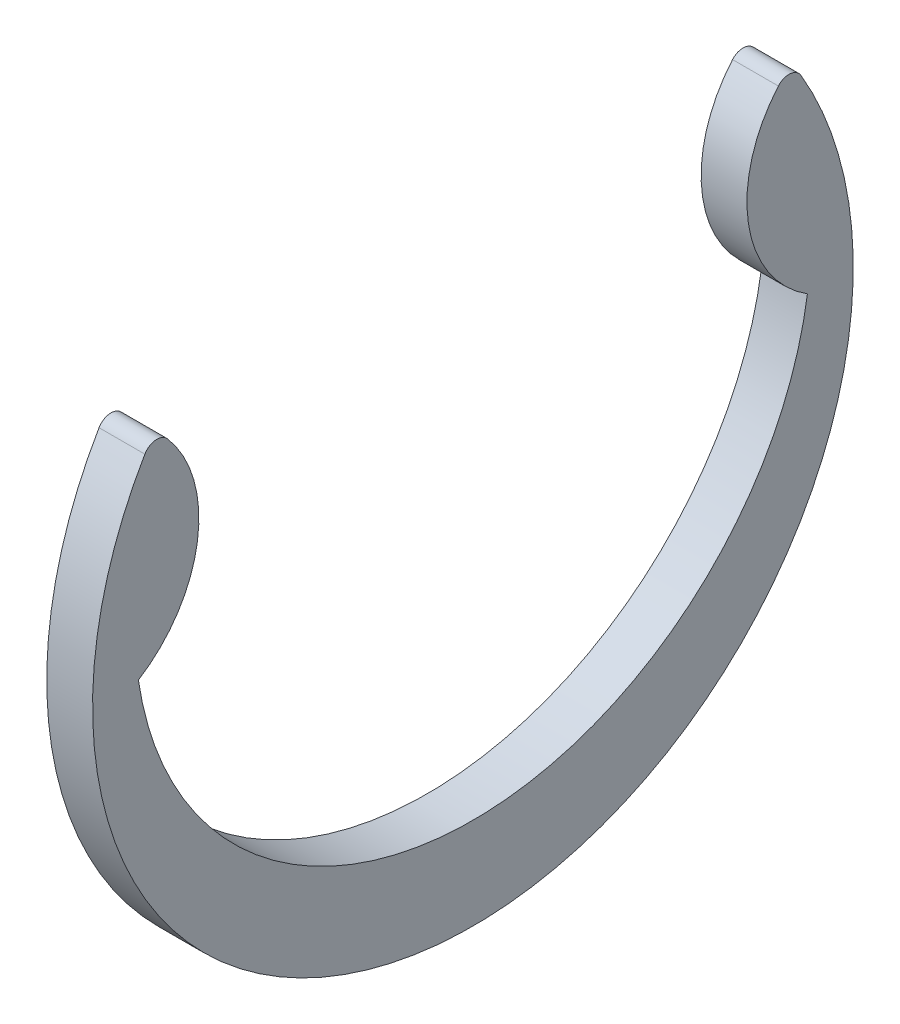
ISO-10303-21;
HEADER;
FILE_DESCRIPTION(('STEP AP214'),'2;1');
FILE_NAME('part.step','',(''),(''),'','','');
FILE_SCHEMA(('AUTOMOTIVE_DESIGN { 1 0 10303 214 1 1 1 1 }'));
ENDSEC;
DATA;
#1=APPLICATION_CONTEXT('core data for automotive mechanical design processes');
#2=APPLICATION_PROTOCOL_DEFINITION('international standard','automotive_design',2000,#1);
#3=PRODUCT_CONTEXT('',#1,'mechanical');
#4=PRODUCT('Part','Part','',(#3));
#5=PRODUCT_RELATED_PRODUCT_CATEGORY('part','',(#4));
#6=PRODUCT_DEFINITION_FORMATION('','',#4);
#7=PRODUCT_DEFINITION_CONTEXT('part definition',#1,'design');
#8=PRODUCT_DEFINITION('design','',#6,#7);
#9=PRODUCT_DEFINITION_SHAPE('','',#8);
#10=(LENGTH_UNIT() NAMED_UNIT(*) SI_UNIT(.MILLI.,.METRE.));
#11=(NAMED_UNIT(*) PLANE_ANGLE_UNIT() SI_UNIT($,.RADIAN.));
#12=(NAMED_UNIT(*) SI_UNIT($,.STERADIAN.) SOLID_ANGLE_UNIT());
#13=UNCERTAINTY_MEASURE_WITH_UNIT(LENGTH_MEASURE(1.E-05),#10,'distance_accuracy_value','');
#14=(GEOMETRIC_REPRESENTATION_CONTEXT(3) GLOBAL_UNCERTAINTY_ASSIGNED_CONTEXT((#13)) GLOBAL_UNIT_ASSIGNED_CONTEXT((#10,
#11,#12)) REPRESENTATION_CONTEXT('',''));
#15=CARTESIAN_POINT('',(0.,0.,0.));
#16=DIRECTION('',(0.,0.,1.));
#17=DIRECTION('',(1.,0.,0.));
#18=AXIS2_PLACEMENT_3D('',#15,#16,#17);
#19=CARTESIAN_POINT('',(0.4445,2.12982885138737,7.8361723947613));
#20=DIRECTION('',(-1.,0.,0.));
#21=DIRECTION('',(0.,0.,1.));
#22=AXIS2_PLACEMENT_3D('',#19,#20,#21);
#23=CYLINDRICAL_SURFACE('',#22,2.5197537272631);
#24=CARTESIAN_POINT('',(-0.4445,2.12982885138737,7.8361723947613));
#25=DIRECTION('',(1.,0.,0.));
#26=DIRECTION('',(0.,0.,1.));
#27=AXIS2_PLACEMENT_3D('',#24,#25,#26);
#28=CIRCLE('',#27,2.5197537272631);
#29=CARTESIAN_POINT('',(-0.4445,0.,6.4897));
#30=VERTEX_POINT('',#29);
#31=CARTESIAN_POINT('',(-0.4445,3.77332947683266,5.92618167744952));
#32=VERTEX_POINT('',#31);
#33=EDGE_CURVE('E118',#30,#32,#28,.T.);
#34=ORIENTED_EDGE('',*,*,#33,.T.);
#35=DIRECTION('',(-1.,0.,0.));
#36=VECTOR('',#35,1.);
#37=CARTESIAN_POINT('',(0.4445,3.77332947683266,5.92618167744952));
#38=LINE('',#37,#36);
#39=CARTESIAN_POINT('',(0.4445,3.77332947683266,5.92618167744952));
#40=VERTEX_POINT('',#39);
#41=EDGE_CURVE('E11',#40,#32,#38,.T.);
#42=ORIENTED_EDGE('',*,*,#41,.F.);
#43=CARTESIAN_POINT('',(0.4445,2.12982885138737,7.8361723947613));
#44=DIRECTION('',(1.,0.,0.));
#45=DIRECTION('',(0.,0.,1.));
#46=AXIS2_PLACEMENT_3D('',#43,#44,#45);
#47=CIRCLE('',#46,2.5197537272631);
#48=CARTESIAN_POINT('',(0.4445,0.,6.4897));
#49=VERTEX_POINT('',#48);
#50=EDGE_CURVE('E128',#49,#40,#47,.T.);
#51=ORIENTED_EDGE('',*,*,#50,.F.);
#52=DIRECTION('',(-1.,0.,0.));
#53=VECTOR('',#52,1.);
#54=CARTESIAN_POINT('',(0.4445,0.,6.4897));
#55=LINE('',#54,#53);
#56=EDGE_CURVE('E114',#49,#30,#55,.T.);
#57=ORIENTED_EDGE('',*,*,#56,.T.);
#58=EDGE_LOOP('',(#34,#42,#51,#57));
#59=FACE_BOUND('',#58,.T.);
#60=ADVANCED_FACE('F34',(#59),#23,.T.);
#61=CARTESIAN_POINT('',(0.4445,3.59700246982915,6.13109972942582));
#62=DIRECTION('',(-1.,0.,0.));
#63=DIRECTION('',(0.,0.,1.));
#64=AXIS2_PLACEMENT_3D('',#61,#62,#63);
#65=CYLINDRICAL_SURFACE('',#64,0.270337976290013);
#66=CARTESIAN_POINT('',(-0.4445,3.59700246982915,6.13109972942582));
#67=DIRECTION('',(1.,0.,0.));
#68=DIRECTION('',(0.,0.,1.));
#69=AXIS2_PLACEMENT_3D('',#66,#67,#68);
#70=CIRCLE('',#69,0.270337976290013);
#71=CARTESIAN_POINT('',(-0.4445,3.7338,6.36427146262634));
#72=VERTEX_POINT('',#71);
#73=EDGE_CURVE('E121',#32,#72,#70,.T.);
#74=ORIENTED_EDGE('',*,*,#73,.T.);
#75=DIRECTION('',(-1.,0.,0.));
#76=VECTOR('',#75,1.);
#77=CARTESIAN_POINT('',(0.4445,3.7338,6.36427146262634));
#78=LINE('',#77,#76);
#79=CARTESIAN_POINT('',(0.4445,3.7338,6.36427146262634));
#80=VERTEX_POINT('',#79);
#81=EDGE_CURVE('E42',#80,#72,#78,.T.);
#82=ORIENTED_EDGE('',*,*,#81,.F.);
#83=CARTESIAN_POINT('',(0.4445,3.59700246982915,6.13109972942582));
#84=DIRECTION('',(1.,0.,0.));
#85=DIRECTION('',(0.,0.,1.));
#86=AXIS2_PLACEMENT_3D('',#83,#84,#85);
#87=CIRCLE('',#86,0.270337976290013);
#88=EDGE_CURVE('E87',#40,#80,#87,.T.);
#89=ORIENTED_EDGE('',*,*,#88,.F.);
#90=ORIENTED_EDGE('',*,*,#41,.T.);
#91=EDGE_LOOP('',(#74,#82,#89,#90));
#92=FACE_BOUND('',#91,.T.);
#93=ADVANCED_FACE('F152',(#92),#65,.T.);
#94=CARTESIAN_POINT('',(0.4445,0.,0.));
#95=DIRECTION('',(-1.,0.,0.));
#96=DIRECTION('',(0.,0.,1.));
#97=AXIS2_PLACEMENT_3D('',#94,#95,#96);
#98=CYLINDRICAL_SURFACE('',#97,7.3787);
#99=CARTESIAN_POINT('',(-0.4445,0.,0.));
#100=DIRECTION('',(1.,0.,0.));
#101=DIRECTION('',(0.,0.,1.));
#102=AXIS2_PLACEMENT_3D('',#99,#100,#101);
#103=CIRCLE('',#102,7.3787);
#104=CARTESIAN_POINT('',(-0.4445,3.7338,-6.36427146262634));
#105=VERTEX_POINT('',#104);
#106=EDGE_CURVE('E123',#72,#105,#103,.T.);
#107=ORIENTED_EDGE('',*,*,#106,.T.);
#108=DIRECTION('',(-1.,0.,0.));
#109=VECTOR('',#108,1.);
#110=CARTESIAN_POINT('',(0.4445,3.7338,-6.36427146262634));
#111=LINE('',#110,#109);
#112=CARTESIAN_POINT('',(0.4445,3.7338,-6.36427146262634));
#113=VERTEX_POINT('',#112);
#114=EDGE_CURVE('E109',#113,#105,#111,.T.);
#115=ORIENTED_EDGE('',*,*,#114,.F.);
#116=CARTESIAN_POINT('',(0.4445,0.,0.));
#117=DIRECTION('',(1.,0.,0.));
#118=DIRECTION('',(0.,0.,1.));
#119=AXIS2_PLACEMENT_3D('',#116,#117,#118);
#120=CIRCLE('',#119,7.3787);
#121=EDGE_CURVE('E100',#80,#113,#120,.T.);
#122=ORIENTED_EDGE('',*,*,#121,.F.);
#123=ORIENTED_EDGE('',*,*,#81,.T.);
#124=EDGE_LOOP('',(#107,#115,#122,#123));
#125=FACE_BOUND('',#124,.T.);
#126=ADVANCED_FACE('F134',(#125),#98,.T.);
#127=CARTESIAN_POINT('',(0.4445,3.59700246982915,-6.13109972942582));
#128=DIRECTION('',(-1.,0.,0.));
#129=DIRECTION('',(0.,0.,1.));
#130=AXIS2_PLACEMENT_3D('',#127,#128,#129);
#131=CYLINDRICAL_SURFACE('',#130,0.270337976290013);
#132=CARTESIAN_POINT('',(-0.4445,3.59700246982915,-6.13109972942582));
#133=DIRECTION('',(1.,0.,0.));
#134=DIRECTION('',(0.,0.,-1.));
#135=AXIS2_PLACEMENT_3D('',#132,#133,#134);
#136=CIRCLE('',#135,0.270337976290013);
#137=CARTESIAN_POINT('',(-0.4445,3.77332947683266,-5.92618167744952));
#138=VERTEX_POINT('',#137);
#139=EDGE_CURVE('E108',#105,#138,#136,.T.);
#140=ORIENTED_EDGE('',*,*,#139,.T.);
#141=DIRECTION('',(-1.,0.,0.));
#142=VECTOR('',#141,1.);
#143=CARTESIAN_POINT('',(0.4445,3.77332947683266,-5.92618167744952));
#144=LINE('',#143,#142);
#145=CARTESIAN_POINT('',(0.4445,3.77332947683266,-5.92618167744952));
#146=VERTEX_POINT('',#145);
#147=EDGE_CURVE('E105',#146,#138,#144,.T.);
#148=ORIENTED_EDGE('',*,*,#147,.F.);
#149=CARTESIAN_POINT('',(0.4445,3.59700246982915,-6.13109972942582));
#150=DIRECTION('',(1.,0.,0.));
#151=DIRECTION('',(0.,0.,-1.));
#152=AXIS2_PLACEMENT_3D('',#149,#150,#151);
#153=CIRCLE('',#152,0.270337976290013);
#154=EDGE_CURVE('E94',#113,#146,#153,.T.);
#155=ORIENTED_EDGE('',*,*,#154,.F.);
#156=ORIENTED_EDGE('',*,*,#114,.T.);
#157=EDGE_LOOP('',(#140,#148,#155,#156));
#158=FACE_BOUND('',#157,.T.);
#159=ADVANCED_FACE('F106',(#158),#131,.T.);
#160=CARTESIAN_POINT('',(0.4445,2.12982885138737,-7.8361723947613));
#161=DIRECTION('',(-1.,0.,0.));
#162=DIRECTION('',(0.,0.,1.));
#163=AXIS2_PLACEMENT_3D('',#160,#161,#162);
#164=CYLINDRICAL_SURFACE('',#163,2.5197537272631);
#165=CARTESIAN_POINT('',(-0.4445,2.12982885138737,-7.8361723947613));
#166=DIRECTION('',(1.,0.,0.));
#167=DIRECTION('',(0.,0.,1.));
#168=AXIS2_PLACEMENT_3D('',#165,#166,#167);
#169=CIRCLE('',#168,2.5197537272631);
#170=CARTESIAN_POINT('',(-0.4445,0.,-6.4897));
#171=VERTEX_POINT('',#170);
#172=EDGE_CURVE('E73',#138,#171,#169,.T.);
#173=ORIENTED_EDGE('',*,*,#172,.T.);
#174=DIRECTION('',(-1.,0.,0.));
#175=VECTOR('',#174,1.);
#176=CARTESIAN_POINT('',(0.4445,0.,-6.4897));
#177=LINE('',#176,#175);
#178=CARTESIAN_POINT('',(0.4445,0.,-6.4897));
#179=VERTEX_POINT('',#178);
#180=EDGE_CURVE('E110',#179,#171,#177,.T.);
#181=ORIENTED_EDGE('',*,*,#180,.F.);
#182=CARTESIAN_POINT('',(0.4445,2.12982885138737,-7.8361723947613));
#183=DIRECTION('',(1.,0.,0.));
#184=DIRECTION('',(0.,0.,1.));
#185=AXIS2_PLACEMENT_3D('',#182,#183,#184);
#186=CIRCLE('',#185,2.5197537272631);
#187=EDGE_CURVE('E98',#146,#179,#186,.T.);
#188=ORIENTED_EDGE('',*,*,#187,.F.);
#189=ORIENTED_EDGE('',*,*,#147,.T.);
#190=EDGE_LOOP('',(#173,#181,#188,#189));
#191=FACE_BOUND('',#190,.T.);
#192=ADVANCED_FACE('F112',(#191),#164,.T.);
#193=CARTESIAN_POINT('',(0.4445,0.959555555555555,0.));
#194=DIRECTION('',(-1.,0.,0.));
#195=DIRECTION('',(0.,0.,1.));
#196=AXIS2_PLACEMENT_3D('',#193,#194,#195);
#197=CYLINDRICAL_SURFACE('',#196,6.56025555555556);
#198=CARTESIAN_POINT('',(-0.4445,0.959555555555555,0.));
#199=DIRECTION('',(-1.,0.,0.));
#200=DIRECTION('',(0.,0.,-1.));
#201=AXIS2_PLACEMENT_3D('',#198,#199,#200);
#202=CIRCLE('',#201,6.56025555555556);
#203=EDGE_CURVE('E79',#171,#30,#202,.T.);
#204=ORIENTED_EDGE('',*,*,#203,.T.);
#205=ORIENTED_EDGE('',*,*,#56,.F.);
#206=CARTESIAN_POINT('',(0.4445,0.959555555555555,0.));
#207=DIRECTION('',(-1.,0.,0.));
#208=DIRECTION('',(0.,0.,-1.));
#209=AXIS2_PLACEMENT_3D('',#206,#207,#208);
#210=CIRCLE('',#209,6.56025555555556);
#211=EDGE_CURVE('E50',#179,#49,#210,.T.);
#212=ORIENTED_EDGE('',*,*,#211,.F.);
#213=ORIENTED_EDGE('',*,*,#180,.T.);
#214=EDGE_LOOP('',(#204,#205,#212,#213));
#215=FACE_BOUND('',#214,.T.);
#216=ADVANCED_FACE('F141',(#215),#197,.F.);
#217=CARTESIAN_POINT('',(0.4445,1.54469220347146,3.91808619738065));
#218=DIRECTION('',(-1.,0.,0.));
#219=DIRECTION('',(0.,0.,1.));
#220=AXIS2_PLACEMENT_3D('',#217,#218,#219);
#221=PLANE('',#220);
#222=ORIENTED_EDGE('',*,*,#50,.T.);
#223=ORIENTED_EDGE('',*,*,#88,.T.);
#224=ORIENTED_EDGE('',*,*,#121,.T.);
#225=ORIENTED_EDGE('',*,*,#154,.T.);
#226=ORIENTED_EDGE('',*,*,#187,.T.);
#227=ORIENTED_EDGE('',*,*,#211,.T.);
#228=EDGE_LOOP('',(#222,#223,#224,#225,#226,#227));
#229=FACE_BOUND('',#228,.T.);
#230=ADVANCED_FACE('F96',(#229),#221,.F.);
#231=CARTESIAN_POINT('',(-0.4445,1.54469220347146,3.91808619738065));
#232=DIRECTION('',(-1.,0.,0.));
#233=DIRECTION('',(0.,0.,1.));
#234=AXIS2_PLACEMENT_3D('',#231,#232,#233);
#235=PLANE('',#234);
#236=ORIENTED_EDGE('',*,*,#33,.F.);
#237=ORIENTED_EDGE('',*,*,#203,.F.);
#238=ORIENTED_EDGE('',*,*,#172,.F.);
#239=ORIENTED_EDGE('',*,*,#139,.F.);
#240=ORIENTED_EDGE('',*,*,#106,.F.);
#241=ORIENTED_EDGE('',*,*,#73,.F.);
#242=EDGE_LOOP('',(#236,#237,#238,#239,#240,#241));
#243=FACE_BOUND('',#242,.T.);
#244=ADVANCED_FACE('F137',(#243),#235,.T.);
#245=CLOSED_SHELL('',(#60,#93,#126,#159,#192,#216,#230,#244));
#246=MANIFOLD_SOLID_BREP('B2',#245);
#247=ADVANCED_BREP_SHAPE_REPRESENTATION('',(#18,#246),#14);
#248=SHAPE_DEFINITION_REPRESENTATION(#9,#247);
ENDSEC;
END-ISO-10303-21;
